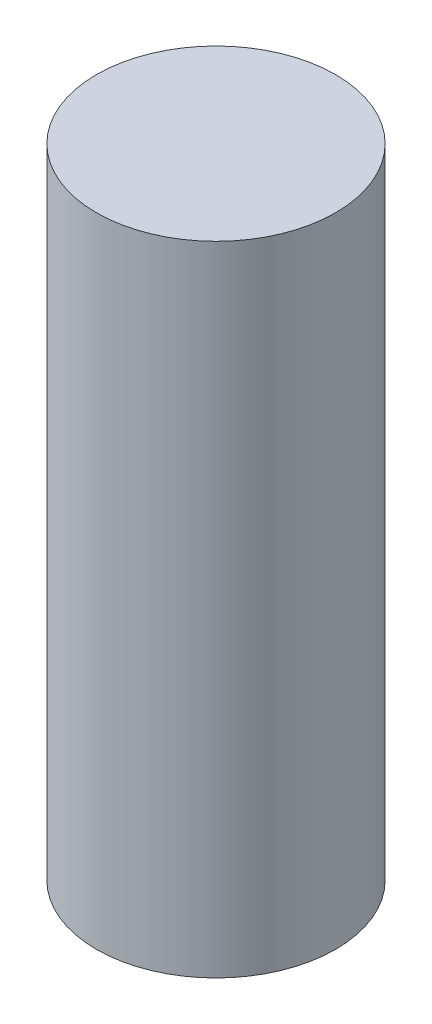
ISO-10303-21;
HEADER;
FILE_DESCRIPTION(('STEP AP214'),'2;1');
FILE_NAME('part.step','',(''),(''),'','','');
FILE_SCHEMA(('AUTOMOTIVE_DESIGN { 1 0 10303 214 1 1 1 1 }'));
ENDSEC;
DATA;
#1=APPLICATION_CONTEXT('core data for automotive mechanical design processes');
#2=APPLICATION_PROTOCOL_DEFINITION('international standard','automotive_design',2000,#1);
#3=PRODUCT_CONTEXT('',#1,'mechanical');
#4=PRODUCT('Part','Part','',(#3));
#5=PRODUCT_RELATED_PRODUCT_CATEGORY('part','',(#4));
#6=PRODUCT_DEFINITION_FORMATION('','',#4);
#7=PRODUCT_DEFINITION_CONTEXT('part definition',#1,'design');
#8=PRODUCT_DEFINITION('design','',#6,#7);
#9=PRODUCT_DEFINITION_SHAPE('','',#8);
#10=(LENGTH_UNIT() NAMED_UNIT(*) SI_UNIT(.MILLI.,.METRE.));
#11=(NAMED_UNIT(*) PLANE_ANGLE_UNIT() SI_UNIT($,.RADIAN.));
#12=(NAMED_UNIT(*) SI_UNIT($,.STERADIAN.) SOLID_ANGLE_UNIT());
#13=UNCERTAINTY_MEASURE_WITH_UNIT(LENGTH_MEASURE(1.E-05),#10,'distance_accuracy_value','');
#14=(GEOMETRIC_REPRESENTATION_CONTEXT(3) GLOBAL_UNCERTAINTY_ASSIGNED_CONTEXT((#13)) GLOBAL_UNIT_ASSIGNED_CONTEXT((#10,
#11,#12)) REPRESENTATION_CONTEXT('',''));
#15=CARTESIAN_POINT('',(0.,0.,0.));
#16=DIRECTION('',(0.,0.,1.));
#17=DIRECTION('',(1.,0.,0.));
#18=AXIS2_PLACEMENT_3D('',#15,#16,#17);
#19=CARTESIAN_POINT('',(0.,25.4,0.));
#20=DIRECTION('',(0.,-1.,0.));
#21=DIRECTION('',(0.,0.,-1.));
#22=AXIS2_PLACEMENT_3D('',#19,#20,#21);
#23=CYLINDRICAL_SURFACE('',#22,4.7625);
#24=CARTESIAN_POINT('',(0.,25.4,0.));
#25=DIRECTION('',(0.,1.,0.));
#26=DIRECTION('',(0.,0.,1.));
#27=AXIS2_PLACEMENT_3D('',#24,#25,#26);
#28=CIRCLE('',#27,4.7625);
#29=CARTESIAN_POINT('',(0.,25.4,4.7625));
#30=VERTEX_POINT('',#29);
#31=EDGE_CURVE('E10',#30,#30,#28,.T.);
#32=ORIENTED_EDGE('',*,*,#31,.F.);
#33=EDGE_LOOP('',(#32));
#34=FACE_BOUND('',#33,.T.);
#35=CARTESIAN_POINT('',(0.,0.,0.));
#36=DIRECTION('',(0.,1.,0.));
#37=DIRECTION('',(0.,0.,1.));
#38=AXIS2_PLACEMENT_3D('',#35,#36,#37);
#39=CIRCLE('',#38,4.7625);
#40=CARTESIAN_POINT('',(0.,0.,4.7625));
#41=VERTEX_POINT('',#40);
#42=EDGE_CURVE('E34',#41,#41,#39,.T.);
#43=ORIENTED_EDGE('',*,*,#42,.T.);
#44=EDGE_LOOP('',(#43));
#45=FACE_BOUND('',#44,.T.);
#46=ADVANCED_FACE('F31',(#34,#45),#23,.T.);
#47=CARTESIAN_POINT('',(0.,25.4,0.));
#48=DIRECTION('',(0.,1.,0.));
#49=DIRECTION('',(0.,0.,1.));
#50=AXIS2_PLACEMENT_3D('',#47,#48,#49);
#51=PLANE('',#50);
#52=ORIENTED_EDGE('',*,*,#31,.T.);
#53=EDGE_LOOP('',(#52));
#54=FACE_BOUND('',#53,.T.);
#55=ADVANCED_FACE('F46',(#54),#51,.T.);
#56=CARTESIAN_POINT('',(0.,0.,0.));
#57=DIRECTION('',(0.,1.,0.));
#58=DIRECTION('',(0.,0.,1.));
#59=AXIS2_PLACEMENT_3D('',#56,#57,#58);
#60=PLANE('',#59);
#61=ORIENTED_EDGE('',*,*,#42,.F.);
#62=EDGE_LOOP('',(#61));
#63=FACE_BOUND('',#62,.T.);
#64=ADVANCED_FACE('F44',(#63),#60,.F.);
#65=CLOSED_SHELL('',(#46,#55,#64));
#66=MANIFOLD_SOLID_BREP('B2',#65);
#67=ADVANCED_BREP_SHAPE_REPRESENTATION('',(#18,#66),#14);
#68=SHAPE_DEFINITION_REPRESENTATION(#9,#67);
ENDSEC;
END-ISO-10303-21;
